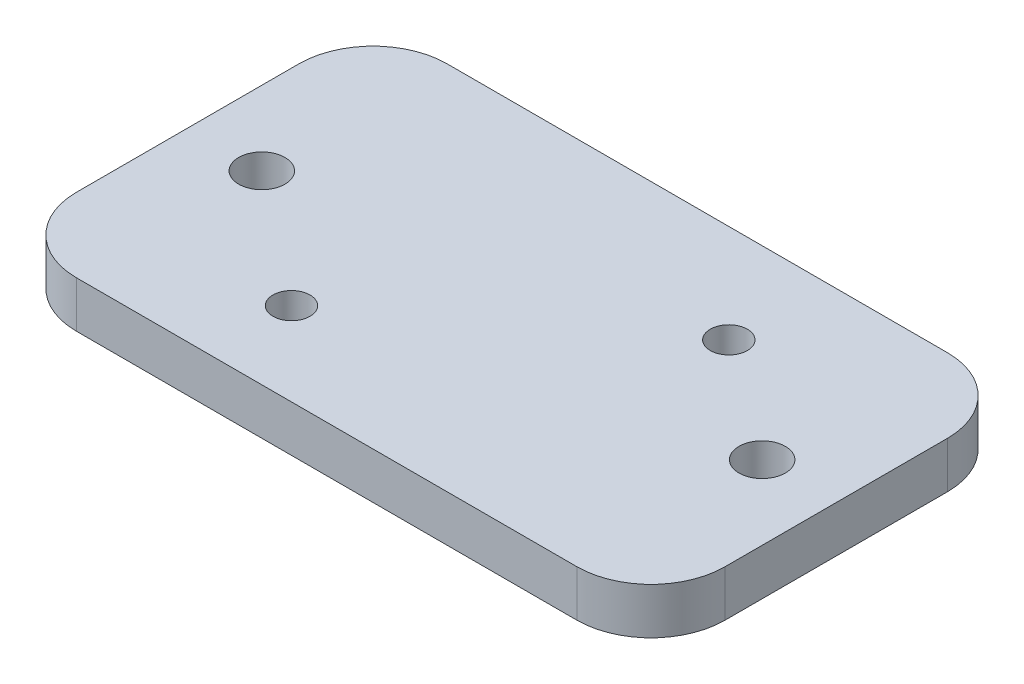
ISO-10303-21;
HEADER;
FILE_DESCRIPTION(('STEP AP214'),'2;1');
FILE_NAME('part.step','',(''),(''),'','','');
FILE_SCHEMA(('AUTOMOTIVE_DESIGN { 1 0 10303 214 1 1 1 1 }'));
ENDSEC;
DATA;
#1=APPLICATION_CONTEXT('core data for automotive mechanical design processes');
#2=APPLICATION_PROTOCOL_DEFINITION('international standard','automotive_design',2000,#1);
#3=PRODUCT_CONTEXT('',#1,'mechanical');
#4=PRODUCT('Part','Part','',(#3));
#5=PRODUCT_RELATED_PRODUCT_CATEGORY('part','',(#4));
#6=PRODUCT_DEFINITION_FORMATION('','',#4);
#7=PRODUCT_DEFINITION_CONTEXT('part definition',#1,'design');
#8=PRODUCT_DEFINITION('design','',#6,#7);
#9=PRODUCT_DEFINITION_SHAPE('','',#8);
#10=(LENGTH_UNIT() NAMED_UNIT(*) SI_UNIT(.MILLI.,.METRE.));
#11=(NAMED_UNIT(*) PLANE_ANGLE_UNIT() SI_UNIT($,.RADIAN.));
#12=(NAMED_UNIT(*) SI_UNIT($,.STERADIAN.) SOLID_ANGLE_UNIT());
#13=UNCERTAINTY_MEASURE_WITH_UNIT(LENGTH_MEASURE(1.E-05),#10,'distance_accuracy_value','');
#14=(GEOMETRIC_REPRESENTATION_CONTEXT(3) GLOBAL_UNCERTAINTY_ASSIGNED_CONTEXT((#13)) GLOBAL_UNIT_ASSIGNED_CONTEXT((#10,
#11,#12)) REPRESENTATION_CONTEXT('',''));
#15=CARTESIAN_POINT('',(0.,0.,0.));
#16=DIRECTION('',(0.,0.,1.));
#17=DIRECTION('',(1.,0.,0.));
#18=AXIS2_PLACEMENT_3D('',#15,#16,#17);
#19=CARTESIAN_POINT('',(5.08,3.175,-5.08));
#20=DIRECTION('',(0.,-1.,0.));
#21=DIRECTION('',(0.,0.,-1.));
#22=AXIS2_PLACEMENT_3D('',#19,#20,#21);
#23=CYLINDRICAL_SURFACE('',#22,5.08);
#24=CARTESIAN_POINT('',(5.08,0.,-5.08));
#25=DIRECTION('',(0.,1.,0.));
#26=DIRECTION('',(0.,0.,-1.));
#27=AXIS2_PLACEMENT_3D('',#24,#25,#26);
#28=CIRCLE('',#27,5.08);
#29=CARTESIAN_POINT('',(0.,0.,-5.08000000000004));
#30=VERTEX_POINT('',#29);
#31=CARTESIAN_POINT('',(5.08000000000004,0.,0.));
#32=VERTEX_POINT('',#31);
#33=EDGE_CURVE('E141',#30,#32,#28,.T.);
#34=ORIENTED_EDGE('',*,*,#33,.T.);
#35=DIRECTION('',(0.,-1.,0.));
#36=VECTOR('',#35,1.);
#37=CARTESIAN_POINT('',(5.08000000000004,3.175,0.));
#38=LINE('',#37,#36);
#39=CARTESIAN_POINT('',(5.08000000000004,3.175,0.));
#40=VERTEX_POINT('',#39);
#41=EDGE_CURVE('E11',#40,#32,#38,.T.);
#42=ORIENTED_EDGE('',*,*,#41,.F.);
#43=CARTESIAN_POINT('',(5.08,3.175,-5.08));
#44=DIRECTION('',(0.,1.,0.));
#45=DIRECTION('',(0.,0.,-1.));
#46=AXIS2_PLACEMENT_3D('',#43,#44,#45);
#47=CIRCLE('',#46,5.08);
#48=CARTESIAN_POINT('',(0.,3.175,-5.08000000000004));
#49=VERTEX_POINT('',#48);
#50=EDGE_CURVE('E157',#49,#40,#47,.T.);
#51=ORIENTED_EDGE('',*,*,#50,.F.);
#52=DIRECTION('',(0.,-1.,0.));
#53=VECTOR('',#52,1.);
#54=CARTESIAN_POINT('',(0.,3.175,-5.08000000000004));
#55=LINE('',#54,#53);
#56=EDGE_CURVE('E137',#49,#30,#55,.T.);
#57=ORIENTED_EDGE('',*,*,#56,.T.);
#58=EDGE_LOOP('',(#34,#42,#51,#57));
#59=FACE_BOUND('',#58,.T.);
#60=ADVANCED_FACE('F33',(#59),#23,.T.);
#61=CARTESIAN_POINT('',(5.08000000000004,3.175,0.));
#62=DIRECTION('',(0.,0.,-1.));
#63=DIRECTION('',(-1.,0.,0.));
#64=AXIS2_PLACEMENT_3D('',#61,#62,#63);
#65=PLANE('',#64);
#66=DIRECTION('',(1.,0.,0.));
#67=VECTOR('',#66,1.);
#68=CARTESIAN_POINT('',(5.08000000000004,0.,0.));
#69=LINE('',#68,#67);
#70=CARTESIAN_POINT('',(39.37,0.,0.));
#71=VERTEX_POINT('',#70);
#72=EDGE_CURVE('E144',#32,#71,#69,.T.);
#73=ORIENTED_EDGE('',*,*,#72,.T.);
#74=DIRECTION('',(0.,-1.,0.));
#75=VECTOR('',#74,1.);
#76=CARTESIAN_POINT('',(39.37,3.175,0.));
#77=LINE('',#76,#75);
#78=CARTESIAN_POINT('',(39.37,3.175,0.));
#79=VERTEX_POINT('',#78);
#80=EDGE_CURVE('E40',#79,#71,#77,.T.);
#81=ORIENTED_EDGE('',*,*,#80,.F.);
#82=DIRECTION('',(1.,0.,0.));
#83=VECTOR('',#82,1.);
#84=CARTESIAN_POINT('',(5.08000000000004,3.175,0.));
#85=LINE('',#84,#83);
#86=EDGE_CURVE('E97',#40,#79,#85,.T.);
#87=ORIENTED_EDGE('',*,*,#86,.F.);
#88=ORIENTED_EDGE('',*,*,#41,.T.);
#89=EDGE_LOOP('',(#73,#81,#87,#88));
#90=FACE_BOUND('',#89,.T.);
#91=ADVANCED_FACE('F285',(#90),#65,.F.);
#92=CARTESIAN_POINT('',(39.37,3.175,-5.08));
#93=DIRECTION('',(0.,-1.,0.));
#94=DIRECTION('',(0.,0.,-1.));
#95=AXIS2_PLACEMENT_3D('',#92,#93,#94);
#96=CYLINDRICAL_SURFACE('',#95,5.08);
#97=CARTESIAN_POINT('',(39.37,0.,-5.08));
#98=DIRECTION('',(0.,1.,0.));
#99=DIRECTION('',(0.,0.,1.));
#100=AXIS2_PLACEMENT_3D('',#97,#98,#99);
#101=CIRCLE('',#100,5.08);
#102=CARTESIAN_POINT('',(44.45,0.,-5.08));
#103=VERTEX_POINT('',#102);
#104=EDGE_CURVE('E147',#71,#103,#101,.T.);
#105=ORIENTED_EDGE('',*,*,#104,.T.);
#106=DIRECTION('',(0.,-1.,0.));
#107=VECTOR('',#106,1.);
#108=CARTESIAN_POINT('',(44.45,3.175,-5.08));
#109=LINE('',#108,#107);
#110=CARTESIAN_POINT('',(44.45,3.175,-5.08));
#111=VERTEX_POINT('',#110);
#112=EDGE_CURVE('E164',#111,#103,#109,.T.);
#113=ORIENTED_EDGE('',*,*,#112,.F.);
#114=CARTESIAN_POINT('',(39.37,3.175,-5.08));
#115=DIRECTION('',(0.,1.,0.));
#116=DIRECTION('',(0.,0.,1.));
#117=AXIS2_PLACEMENT_3D('',#114,#115,#116);
#118=CIRCLE('',#117,5.08);
#119=EDGE_CURVE('E172',#79,#111,#118,.T.);
#120=ORIENTED_EDGE('',*,*,#119,.F.);
#121=ORIENTED_EDGE('',*,*,#80,.T.);
#122=EDGE_LOOP('',(#105,#113,#120,#121));
#123=FACE_BOUND('',#122,.T.);
#124=ADVANCED_FACE('F170',(#123),#96,.T.);
#125=CARTESIAN_POINT('',(44.45,3.175,-5.08));
#126=DIRECTION('',(-1.,0.,0.));
#127=DIRECTION('',(0.,0.,1.));
#128=AXIS2_PLACEMENT_3D('',#125,#126,#127);
#129=PLANE('',#128);
#130=DIRECTION('',(0.,0.,-1.));
#131=VECTOR('',#130,1.);
#132=CARTESIAN_POINT('',(44.45,0.,-5.08));
#133=LINE('',#132,#131);
#134=CARTESIAN_POINT('',(44.45,0.,-20.32));
#135=VERTEX_POINT('',#134);
#136=EDGE_CURVE('E149',#103,#135,#133,.T.);
#137=ORIENTED_EDGE('',*,*,#136,.T.);
#138=DIRECTION('',(0.,-1.,0.));
#139=VECTOR('',#138,1.);
#140=CARTESIAN_POINT('',(44.45,3.175,-20.32));
#141=LINE('',#140,#139);
#142=CARTESIAN_POINT('',(44.45,3.175,-20.32));
#143=VERTEX_POINT('',#142);
#144=EDGE_CURVE('E161',#143,#135,#141,.T.);
#145=ORIENTED_EDGE('',*,*,#144,.F.);
#146=DIRECTION('',(0.,0.,-1.));
#147=VECTOR('',#146,1.);
#148=CARTESIAN_POINT('',(44.45,3.175,-5.08));
#149=LINE('',#148,#147);
#150=EDGE_CURVE('E184',#111,#143,#149,.T.);
#151=ORIENTED_EDGE('',*,*,#150,.F.);
#152=ORIENTED_EDGE('',*,*,#112,.T.);
#153=EDGE_LOOP('',(#137,#145,#151,#152));
#154=FACE_BOUND('',#153,.T.);
#155=ADVANCED_FACE('F180',(#154),#129,.F.);
#156=CARTESIAN_POINT('',(39.37,3.175,-20.32));
#157=DIRECTION('',(0.,-1.,0.));
#158=DIRECTION('',(0.,0.,-1.));
#159=AXIS2_PLACEMENT_3D('',#156,#157,#158);
#160=CYLINDRICAL_SURFACE('',#159,5.08);
#161=CARTESIAN_POINT('',(39.37,0.,-20.32));
#162=DIRECTION('',(0.,1.,0.));
#163=DIRECTION('',(0.,0.,-1.));
#164=AXIS2_PLACEMENT_3D('',#161,#162,#163);
#165=CIRCLE('',#164,5.08);
#166=CARTESIAN_POINT('',(39.37,0.,-25.4));
#167=VERTEX_POINT('',#166);
#168=EDGE_CURVE('E151',#135,#167,#165,.T.);
#169=ORIENTED_EDGE('',*,*,#168,.T.);
#170=DIRECTION('',(0.,-1.,0.));
#171=VECTOR('',#170,1.);
#172=CARTESIAN_POINT('',(39.37,3.175,-25.4));
#173=LINE('',#172,#171);
#174=CARTESIAN_POINT('',(39.37,3.175,-25.4));
#175=VERTEX_POINT('',#174);
#176=EDGE_CURVE('E132',#175,#167,#173,.T.);
#177=ORIENTED_EDGE('',*,*,#176,.F.);
#178=CARTESIAN_POINT('',(39.37,3.175,-20.32));
#179=DIRECTION('',(0.,1.,0.));
#180=DIRECTION('',(0.,0.,-1.));
#181=AXIS2_PLACEMENT_3D('',#178,#179,#180);
#182=CIRCLE('',#181,5.08);
#183=EDGE_CURVE('E120',#143,#175,#182,.T.);
#184=ORIENTED_EDGE('',*,*,#183,.F.);
#185=ORIENTED_EDGE('',*,*,#144,.T.);
#186=EDGE_LOOP('',(#169,#177,#184,#185));
#187=FACE_BOUND('',#186,.T.);
#188=ADVANCED_FACE('F183',(#187),#160,.T.);
#189=CARTESIAN_POINT('',(5.08000000000004,3.175,-25.4));
#190=DIRECTION('',(0.,0.,1.));
#191=DIRECTION('',(1.,0.,0.));
#192=AXIS2_PLACEMENT_3D('',#189,#190,#191);
#193=PLANE('',#192);
#194=DIRECTION('',(-1.,0.,0.));
#195=VECTOR('',#194,1.);
#196=CARTESIAN_POINT('',(5.08000000000004,0.,-25.4));
#197=LINE('',#196,#195);
#198=CARTESIAN_POINT('',(5.08000000000004,0.,-25.4));
#199=VERTEX_POINT('',#198);
#200=EDGE_CURVE('E129',#167,#199,#197,.T.);
#201=ORIENTED_EDGE('',*,*,#200,.T.);
#202=DIRECTION('',(0.,-1.,0.));
#203=VECTOR('',#202,1.);
#204=CARTESIAN_POINT('',(5.08000000000004,3.175,-25.4));
#205=LINE('',#204,#203);
#206=CARTESIAN_POINT('',(5.08000000000004,3.175,-25.4));
#207=VERTEX_POINT('',#206);
#208=EDGE_CURVE('E126',#207,#199,#205,.T.);
#209=ORIENTED_EDGE('',*,*,#208,.F.);
#210=DIRECTION('',(-1.,0.,0.));
#211=VECTOR('',#210,1.);
#212=CARTESIAN_POINT('',(5.08000000000004,3.175,-25.4));
#213=LINE('',#212,#211);
#214=EDGE_CURVE('E113',#175,#207,#213,.T.);
#215=ORIENTED_EDGE('',*,*,#214,.F.);
#216=ORIENTED_EDGE('',*,*,#176,.T.);
#217=EDGE_LOOP('',(#201,#209,#215,#216));
#218=FACE_BOUND('',#217,.T.);
#219=ADVANCED_FACE('F127',(#218),#193,.F.);
#220=CARTESIAN_POINT('',(5.08,3.175,-20.32));
#221=DIRECTION('',(0.,-1.,0.));
#222=DIRECTION('',(0.,0.,-1.));
#223=AXIS2_PLACEMENT_3D('',#220,#221,#222);
#224=CYLINDRICAL_SURFACE('',#223,5.08);
#225=CARTESIAN_POINT('',(5.08,0.,-20.32));
#226=DIRECTION('',(0.,1.,0.));
#227=DIRECTION('',(0.,0.,-1.));
#228=AXIS2_PLACEMENT_3D('',#225,#226,#227);
#229=CIRCLE('',#228,5.08);
#230=CARTESIAN_POINT('',(0.,0.,-20.32));
#231=VERTEX_POINT('',#230);
#232=EDGE_CURVE('E154',#199,#231,#229,.T.);
#233=ORIENTED_EDGE('',*,*,#232,.T.);
#234=DIRECTION('',(0.,-1.,0.));
#235=VECTOR('',#234,1.);
#236=CARTESIAN_POINT('',(0.,3.175,-20.32));
#237=LINE('',#236,#235);
#238=CARTESIAN_POINT('',(0.,3.175,-20.32));
#239=VERTEX_POINT('',#238);
#240=EDGE_CURVE('E133',#239,#231,#237,.T.);
#241=ORIENTED_EDGE('',*,*,#240,.F.);
#242=CARTESIAN_POINT('',(5.08,3.175,-20.32));
#243=DIRECTION('',(0.,1.,0.));
#244=DIRECTION('',(0.,0.,-1.));
#245=AXIS2_PLACEMENT_3D('',#242,#243,#244);
#246=CIRCLE('',#245,5.08);
#247=EDGE_CURVE('E117',#207,#239,#246,.T.);
#248=ORIENTED_EDGE('',*,*,#247,.F.);
#249=ORIENTED_EDGE('',*,*,#208,.T.);
#250=EDGE_LOOP('',(#233,#241,#248,#249));
#251=FACE_BOUND('',#250,.T.);
#252=ADVANCED_FACE('F135',(#251),#224,.T.);
#253=CARTESIAN_POINT('',(0.,3.175,-5.08000000000004));
#254=DIRECTION('',(1.,0.,0.));
#255=DIRECTION('',(0.,0.,-1.));
#256=AXIS2_PLACEMENT_3D('',#253,#254,#255);
#257=PLANE('',#256);
#258=DIRECTION('',(0.,0.,1.));
#259=VECTOR('',#258,1.);
#260=CARTESIAN_POINT('',(0.,0.,-5.08000000000004));
#261=LINE('',#260,#259);
#262=EDGE_CURVE('E89',#231,#30,#261,.T.);
#263=ORIENTED_EDGE('',*,*,#262,.T.);
#264=ORIENTED_EDGE('',*,*,#56,.F.);
#265=DIRECTION('',(0.,0.,1.));
#266=VECTOR('',#265,1.);
#267=CARTESIAN_POINT('',(0.,3.175,-5.08000000000004));
#268=LINE('',#267,#266);
#269=EDGE_CURVE('E56',#239,#49,#268,.T.);
#270=ORIENTED_EDGE('',*,*,#269,.F.);
#271=ORIENTED_EDGE('',*,*,#240,.T.);
#272=EDGE_LOOP('',(#263,#264,#270,#271));
#273=FACE_BOUND('',#272,.T.);
#274=ADVANCED_FACE('F292',(#273),#257,.F.);
#275=CARTESIAN_POINT('',(5.08,3.175,-5.08));
#276=DIRECTION('',(0.,-1.,0.));
#277=DIRECTION('',(0.,0.,-1.));
#278=AXIS2_PLACEMENT_3D('',#275,#276,#277);
#279=PLANE('',#278);
#280=CARTESIAN_POINT('',(14.097,3.175,-5.715));
#281=DIRECTION('',(0.,-1.,0.));
#282=DIRECTION('',(0.,0.,-1.));
#283=AXIS2_PLACEMENT_3D('',#280,#281,#282);
#284=CIRCLE('',#283,1.27);
#285=CARTESIAN_POINT('',(14.097,3.175,-6.985));
#286=VERTEX_POINT('',#285);
#287=EDGE_CURVE('E197',#286,#286,#284,.F.);
#288=ORIENTED_EDGE('',*,*,#287,.F.);
#289=EDGE_LOOP('',(#288));
#290=FACE_BOUND('',#289,.T.);
#291=CARTESIAN_POINT('',(31.115,3.175,-18.669));
#292=DIRECTION('',(0.,-1.,0.));
#293=DIRECTION('',(0.,0.,-1.));
#294=AXIS2_PLACEMENT_3D('',#291,#292,#293);
#295=CIRCLE('',#294,1.26999999999999);
#296=CARTESIAN_POINT('',(31.115,3.175,-19.939));
#297=VERTEX_POINT('',#296);
#298=EDGE_CURVE('E202',#297,#297,#295,.F.);
#299=ORIENTED_EDGE('',*,*,#298,.F.);
#300=EDGE_LOOP('',(#299));
#301=FACE_BOUND('',#300,.T.);
#302=CARTESIAN_POINT('',(5.08,3.175,-12.7));
#303=DIRECTION('',(0.,-1.,0.));
#304=DIRECTION('',(0.,0.,-1.));
#305=AXIS2_PLACEMENT_3D('',#302,#303,#304);
#306=CIRCLE('',#305,1.5875);
#307=CARTESIAN_POINT('',(5.08,3.175,-14.2875));
#308=VERTEX_POINT('',#307);
#309=EDGE_CURVE('E145',#308,#308,#306,.F.);
#310=ORIENTED_EDGE('',*,*,#309,.F.);
#311=EDGE_LOOP('',(#310));
#312=FACE_BOUND('',#311,.T.);
#313=CARTESIAN_POINT('',(39.37,3.175,-12.7));
#314=DIRECTION('',(0.,-1.,0.));
#315=DIRECTION('',(0.,0.,-1.));
#316=AXIS2_PLACEMENT_3D('',#313,#314,#315);
#317=CIRCLE('',#316,1.5875);
#318=CARTESIAN_POINT('',(39.37,3.175,-14.2875));
#319=VERTEX_POINT('',#318);
#320=EDGE_CURVE('E190',#319,#319,#317,.F.);
#321=ORIENTED_EDGE('',*,*,#320,.F.);
#322=EDGE_LOOP('',(#321));
#323=FACE_BOUND('',#322,.T.);
#324=ORIENTED_EDGE('',*,*,#50,.T.);
#325=ORIENTED_EDGE('',*,*,#86,.T.);
#326=ORIENTED_EDGE('',*,*,#119,.T.);
#327=ORIENTED_EDGE('',*,*,#150,.T.);
#328=ORIENTED_EDGE('',*,*,#183,.T.);
#329=ORIENTED_EDGE('',*,*,#214,.T.);
#330=ORIENTED_EDGE('',*,*,#247,.T.);
#331=ORIENTED_EDGE('',*,*,#269,.T.);
#332=EDGE_LOOP('',(#324,#325,#326,#327,#328,#329,#330,#331));
#333=FACE_BOUND('',#332,.T.);
#334=ADVANCED_FACE('F115',(#290,#301,#312,#323,#333),#279,.F.);
#335=CARTESIAN_POINT('',(5.08,0.,-5.08));
#336=DIRECTION('',(0.,-1.,0.));
#337=DIRECTION('',(0.,0.,-1.));
#338=AXIS2_PLACEMENT_3D('',#335,#336,#337);
#339=PLANE('',#338);
#340=CARTESIAN_POINT('',(13.3435083499975,0.,-21.2723461132841));
#341=DIRECTION('',(0.,-1.,0.));
#342=DIRECTION('',(0.,0.,-1.));
#343=AXIS2_PLACEMENT_3D('',#340,#341,#342);
#344=CIRCLE('',#343,1.37822275893178);
#345=CARTESIAN_POINT('',(13.3435083499975,0.,-19.8941233543523));
#346=VERTEX_POINT('',#345);
#347=CARTESIAN_POINT('',(13.3435083499975,0.,-22.6505688722159));
#348=VERTEX_POINT('',#347);
#349=EDGE_CURVE('E47',#346,#348,#344,.T.);
#350=ORIENTED_EDGE('',*,*,#349,.F.);
#351=DIRECTION('',(-1.,0.,0.));
#352=VECTOR('',#351,1.);
#353=CARTESIAN_POINT('',(13.3435083499975,0.,-19.8941233543523));
#354=LINE('',#353,#352);
#355=CARTESIAN_POINT('',(29.0312449885803,0.,-19.8941233543523));
#356=VERTEX_POINT('',#355);
#357=EDGE_CURVE('E224',#356,#346,#354,.T.);
#358=ORIENTED_EDGE('',*,*,#357,.F.);
#359=CARTESIAN_POINT('',(29.0312449885803,0.,-21.2723461132841));
#360=DIRECTION('',(0.,-1.,0.));
#361=DIRECTION('',(0.,0.,-1.));
#362=AXIS2_PLACEMENT_3D('',#359,#360,#361);
#363=CIRCLE('',#362,1.37822275893178);
#364=CARTESIAN_POINT('',(29.0312449885803,0.,-22.6505688722159));
#365=VERTEX_POINT('',#364);
#366=EDGE_CURVE('E228',#365,#356,#363,.T.);
#367=ORIENTED_EDGE('',*,*,#366,.F.);
#368=DIRECTION('',(1.,0.,0.));
#369=VECTOR('',#368,1.);
#370=CARTESIAN_POINT('',(13.3435083499975,0.,-22.6505688722159));
#371=LINE('',#370,#369);
#372=EDGE_CURVE('E231',#348,#365,#371,.T.);
#373=ORIENTED_EDGE('',*,*,#372,.F.);
#374=EDGE_LOOP('',(#350,#358,#367,#373));
#375=FACE_BOUND('',#374,.T.);
#376=CARTESIAN_POINT('',(14.097,0.,-5.715));
#377=DIRECTION('',(0.,-1.,0.));
#378=DIRECTION('',(0.,0.,-1.));
#379=AXIS2_PLACEMENT_3D('',#376,#377,#378);
#380=CIRCLE('',#379,1.27);
#381=CARTESIAN_POINT('',(14.097,0.,-6.985));
#382=VERTEX_POINT('',#381);
#383=EDGE_CURVE('E205',#382,#382,#380,.T.);
#384=ORIENTED_EDGE('',*,*,#383,.F.);
#385=EDGE_LOOP('',(#384));
#386=FACE_BOUND('',#385,.T.);
#387=CARTESIAN_POINT('',(31.115,0.,-18.669));
#388=DIRECTION('',(0.,-1.,0.));
#389=DIRECTION('',(0.,0.,-1.));
#390=AXIS2_PLACEMENT_3D('',#387,#388,#389);
#391=CIRCLE('',#390,1.26999999999999);
#392=CARTESIAN_POINT('',(31.115,0.,-19.939));
#393=VERTEX_POINT('',#392);
#394=EDGE_CURVE('E206',#393,#393,#391,.T.);
#395=ORIENTED_EDGE('',*,*,#394,.F.);
#396=EDGE_LOOP('',(#395));
#397=FACE_BOUND('',#396,.T.);
#398=CARTESIAN_POINT('',(5.08,0.,-12.7));
#399=DIRECTION('',(0.,-1.,0.));
#400=DIRECTION('',(0.,0.,-1.));
#401=AXIS2_PLACEMENT_3D('',#398,#399,#400);
#402=CIRCLE('',#401,1.5875);
#403=CARTESIAN_POINT('',(5.08,0.,-14.2875));
#404=VERTEX_POINT('',#403);
#405=EDGE_CURVE('E193',#404,#404,#402,.T.);
#406=ORIENTED_EDGE('',*,*,#405,.F.);
#407=EDGE_LOOP('',(#406));
#408=FACE_BOUND('',#407,.T.);
#409=CARTESIAN_POINT('',(39.37,0.,-12.7));
#410=DIRECTION('',(0.,-1.,0.));
#411=DIRECTION('',(0.,0.,1.));
#412=AXIS2_PLACEMENT_3D('',#409,#410,#411);
#413=CIRCLE('',#412,1.5875);
#414=CARTESIAN_POINT('',(39.37,0.,-11.1125));
#415=VERTEX_POINT('',#414);
#416=EDGE_CURVE('E194',#415,#415,#413,.T.);
#417=ORIENTED_EDGE('',*,*,#416,.F.);
#418=EDGE_LOOP('',(#417));
#419=FACE_BOUND('',#418,.T.);
#420=ORIENTED_EDGE('',*,*,#33,.F.);
#421=ORIENTED_EDGE('',*,*,#262,.F.);
#422=ORIENTED_EDGE('',*,*,#232,.F.);
#423=ORIENTED_EDGE('',*,*,#200,.F.);
#424=ORIENTED_EDGE('',*,*,#168,.F.);
#425=ORIENTED_EDGE('',*,*,#136,.F.);
#426=ORIENTED_EDGE('',*,*,#104,.F.);
#427=ORIENTED_EDGE('',*,*,#72,.F.);
#428=EDGE_LOOP('',(#420,#421,#422,#423,#424,#425,#426,#427));
#429=FACE_BOUND('',#428,.T.);
#430=ADVANCED_FACE('F176',(#375,#386,#397,#408,#419,#429),#339,.T.);
#431=CARTESIAN_POINT('',(39.37,3.176,-12.7));
#432=DIRECTION('',(0.,-1.,0.));
#433=DIRECTION('',(0.,0.,-1.));
#434=AXIS2_PLACEMENT_3D('',#431,#432,#433);
#435=CYLINDRICAL_SURFACE('',#434,1.5875);
#436=ORIENTED_EDGE('',*,*,#416,.T.);
#437=EDGE_LOOP('',(#436));
#438=FACE_BOUND('',#437,.T.);
#439=ORIENTED_EDGE('',*,*,#320,.T.);
#440=EDGE_LOOP('',(#439));
#441=FACE_BOUND('',#440,.T.);
#442=ADVANCED_FACE('F341',(#438,#441),#435,.F.);
#443=CARTESIAN_POINT('',(5.08,3.176,-12.7));
#444=DIRECTION('',(0.,-1.,0.));
#445=DIRECTION('',(0.,0.,-1.));
#446=AXIS2_PLACEMENT_3D('',#443,#444,#445);
#447=CYLINDRICAL_SURFACE('',#446,1.5875);
#448=ORIENTED_EDGE('',*,*,#405,.T.);
#449=EDGE_LOOP('',(#448));
#450=FACE_BOUND('',#449,.T.);
#451=ORIENTED_EDGE('',*,*,#309,.T.);
#452=EDGE_LOOP('',(#451));
#453=FACE_BOUND('',#452,.T.);
#454=ADVANCED_FACE('F346',(#450,#453),#447,.F.);
#455=CARTESIAN_POINT('',(31.115,3.176,-18.669));
#456=DIRECTION('',(0.,-1.,0.));
#457=DIRECTION('',(0.,0.,-1.));
#458=AXIS2_PLACEMENT_3D('',#455,#456,#457);
#459=CYLINDRICAL_SURFACE('',#458,1.26999999999999);
#460=ORIENTED_EDGE('',*,*,#394,.T.);
#461=EDGE_LOOP('',(#460));
#462=FACE_BOUND('',#461,.T.);
#463=ORIENTED_EDGE('',*,*,#298,.T.);
#464=EDGE_LOOP('',(#463));
#465=FACE_BOUND('',#464,.T.);
#466=ADVANCED_FACE('F358',(#462,#465),#459,.F.);
#467=CARTESIAN_POINT('',(14.097,3.176,-5.715));
#468=DIRECTION('',(0.,-1.,0.));
#469=DIRECTION('',(0.,0.,-1.));
#470=AXIS2_PLACEMENT_3D('',#467,#468,#469);
#471=CYLINDRICAL_SURFACE('',#470,1.27);
#472=ORIENTED_EDGE('',*,*,#383,.T.);
#473=EDGE_LOOP('',(#472));
#474=FACE_BOUND('',#473,.T.);
#475=ORIENTED_EDGE('',*,*,#287,.T.);
#476=EDGE_LOOP('',(#475));
#477=FACE_BOUND('',#476,.T.);
#478=ADVANCED_FACE('F373',(#474,#477),#471,.F.);
#479=CARTESIAN_POINT('',(13.3435083499975,1.5875,-21.2723461132841));
#480=DIRECTION('',(0.,-1.,0.));
#481=DIRECTION('',(0.,0.,-1.));
#482=AXIS2_PLACEMENT_3D('',#479,#480,#481);
#483=CYLINDRICAL_SURFACE('',#482,1.37822275893178);
#484=ORIENTED_EDGE('',*,*,#349,.T.);
#485=DIRECTION('',(0.,-1.,0.));
#486=VECTOR('',#485,1.);
#487=CARTESIAN_POINT('',(13.3435083499975,1.5875,-22.6505688722159));
#488=LINE('',#487,#486);
#489=CARTESIAN_POINT('',(13.3435083499975,1.5875,-22.6505688722159));
#490=VERTEX_POINT('',#489);
#491=EDGE_CURVE('E214',#490,#348,#488,.T.);
#492=ORIENTED_EDGE('',*,*,#491,.F.);
#493=CARTESIAN_POINT('',(13.3435083499975,1.5875,-21.2723461132841));
#494=DIRECTION('',(0.,-1.,0.));
#495=DIRECTION('',(0.,0.,-1.));
#496=AXIS2_PLACEMENT_3D('',#493,#494,#495);
#497=CIRCLE('',#496,1.37822275893178);
#498=CARTESIAN_POINT('',(13.3435083499975,1.5875,-19.8941233543523));
#499=VERTEX_POINT('',#498);
#500=EDGE_CURVE('E227',#499,#490,#497,.T.);
#501=ORIENTED_EDGE('',*,*,#500,.F.);
#502=DIRECTION('',(0.,-1.,0.));
#503=VECTOR('',#502,1.);
#504=CARTESIAN_POINT('',(13.3435083499975,1.5875,-19.8941233543523));
#505=LINE('',#504,#503);
#506=EDGE_CURVE('E209',#499,#346,#505,.T.);
#507=ORIENTED_EDGE('',*,*,#506,.T.);
#508=EDGE_LOOP('',(#484,#492,#501,#507));
#509=FACE_BOUND('',#508,.T.);
#510=ADVANCED_FACE('F252',(#509),#483,.F.);
#511=CARTESIAN_POINT('',(13.3435083499975,1.5875,-19.8941233543523));
#512=DIRECTION('',(0.,0.,1.));
#513=DIRECTION('',(1.,0.,0.));
#514=AXIS2_PLACEMENT_3D('',#511,#512,#513);
#515=PLANE('',#514);
#516=ORIENTED_EDGE('',*,*,#357,.T.);
#517=ORIENTED_EDGE('',*,*,#506,.F.);
#518=DIRECTION('',(-1.,0.,0.));
#519=VECTOR('',#518,1.);
#520=CARTESIAN_POINT('',(13.3435083499975,1.5875,-19.8941233543523));
#521=LINE('',#520,#519);
#522=CARTESIAN_POINT('',(29.0312449885803,1.5875,-19.8941233543523));
#523=VERTEX_POINT('',#522);
#524=EDGE_CURVE('E217',#523,#499,#521,.T.);
#525=ORIENTED_EDGE('',*,*,#524,.F.);
#526=DIRECTION('',(0.,-1.,0.));
#527=VECTOR('',#526,1.);
#528=CARTESIAN_POINT('',(29.0312449885803,1.5875,-19.8941233543523));
#529=LINE('',#528,#527);
#530=EDGE_CURVE('E220',#523,#356,#529,.T.);
#531=ORIENTED_EDGE('',*,*,#530,.T.);
#532=EDGE_LOOP('',(#516,#517,#525,#531));
#533=FACE_BOUND('',#532,.T.);
#534=ADVANCED_FACE('F263',(#533),#515,.F.);
#535=CARTESIAN_POINT('',(29.0312449885803,1.5875,-21.2723461132841));
#536=DIRECTION('',(0.,-1.,0.));
#537=DIRECTION('',(0.,0.,-1.));
#538=AXIS2_PLACEMENT_3D('',#535,#536,#537);
#539=CYLINDRICAL_SURFACE('',#538,1.37822275893178);
#540=ORIENTED_EDGE('',*,*,#366,.T.);
#541=ORIENTED_EDGE('',*,*,#530,.F.);
#542=CARTESIAN_POINT('',(29.0312449885803,1.5875,-21.2723461132841));
#543=DIRECTION('',(0.,-1.,0.));
#544=DIRECTION('',(0.,0.,-1.));
#545=AXIS2_PLACEMENT_3D('',#542,#543,#544);
#546=CIRCLE('',#545,1.37822275893178);
#547=CARTESIAN_POINT('',(29.0312449885803,1.5875,-22.6505688722159));
#548=VERTEX_POINT('',#547);
#549=EDGE_CURVE('E237',#548,#523,#546,.T.);
#550=ORIENTED_EDGE('',*,*,#549,.F.);
#551=DIRECTION('',(0.,-1.,0.));
#552=VECTOR('',#551,1.);
#553=CARTESIAN_POINT('',(29.0312449885803,1.5875,-22.6505688722159));
#554=LINE('',#553,#552);
#555=EDGE_CURVE('E216',#548,#365,#554,.T.);
#556=ORIENTED_EDGE('',*,*,#555,.T.);
#557=EDGE_LOOP('',(#540,#541,#550,#556));
#558=FACE_BOUND('',#557,.T.);
#559=ADVANCED_FACE('F268',(#558),#539,.F.);
#560=CARTESIAN_POINT('',(13.3435083499975,1.5875,-22.6505688722159));
#561=DIRECTION('',(0.,0.,-1.));
#562=DIRECTION('',(-1.,0.,0.));
#563=AXIS2_PLACEMENT_3D('',#560,#561,#562);
#564=PLANE('',#563);
#565=ORIENTED_EDGE('',*,*,#372,.T.);
#566=ORIENTED_EDGE('',*,*,#555,.F.);
#567=DIRECTION('',(1.,0.,0.));
#568=VECTOR('',#567,1.);
#569=CARTESIAN_POINT('',(13.3435083499975,1.5875,-22.6505688722159));
#570=LINE('',#569,#568);
#571=EDGE_CURVE('E240',#490,#548,#570,.T.);
#572=ORIENTED_EDGE('',*,*,#571,.F.);
#573=ORIENTED_EDGE('',*,*,#491,.T.);
#574=EDGE_LOOP('',(#565,#566,#572,#573));
#575=FACE_BOUND('',#574,.T.);
#576=ADVANCED_FACE('F274',(#575),#564,.F.);
#577=CARTESIAN_POINT('',(13.3435083499975,1.5875,-21.2723461132841));
#578=DIRECTION('',(0.,-1.,0.));
#579=DIRECTION('',(0.,0.,-1.));
#580=AXIS2_PLACEMENT_3D('',#577,#578,#579);
#581=PLANE('',#580);
#582=ORIENTED_EDGE('',*,*,#500,.T.);
#583=ORIENTED_EDGE('',*,*,#571,.T.);
#584=ORIENTED_EDGE('',*,*,#549,.T.);
#585=ORIENTED_EDGE('',*,*,#524,.T.);
#586=EDGE_LOOP('',(#582,#583,#584,#585));
#587=FACE_BOUND('',#586,.T.);
#588=ADVANCED_FACE('F247',(#587),#581,.T.);
#589=CLOSED_SHELL('',(#60,#91,#124,#155,#188,#219,#252,#274,#334,#430,#442,#454,#466,#478,#510,
#534,#559,#576,#588));
#590=MANIFOLD_SOLID_BREP('B2',#589);
#591=ADVANCED_BREP_SHAPE_REPRESENTATION('',(#18,#590),#14);
#592=SHAPE_DEFINITION_REPRESENTATION(#9,#591);
ENDSEC;
END-ISO-10303-21;
